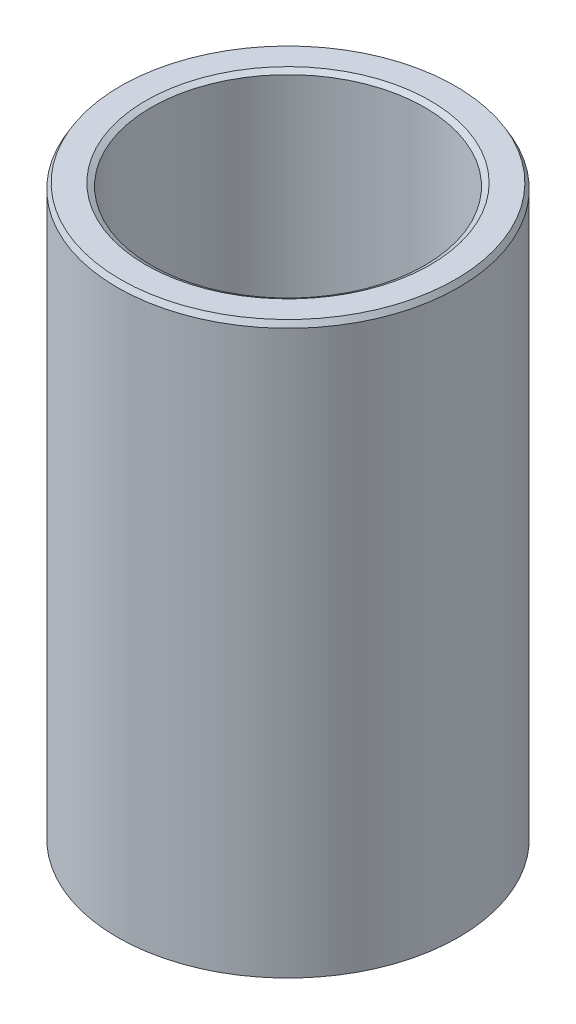
ISO-10303-21;
HEADER;
FILE_DESCRIPTION(('STEP AP214'),'2;1');
FILE_NAME('part.step','',(''),(''),'','','');
FILE_SCHEMA(('AUTOMOTIVE_DESIGN { 1 0 10303 214 1 1 1 1 }'));
ENDSEC;
DATA;
#1=APPLICATION_CONTEXT('core data for automotive mechanical design processes');
#2=APPLICATION_PROTOCOL_DEFINITION('international standard','automotive_design',2000,#1);
#3=PRODUCT_CONTEXT('',#1,'mechanical');
#4=PRODUCT('Part','Part','',(#3));
#5=PRODUCT_RELATED_PRODUCT_CATEGORY('part','',(#4));
#6=PRODUCT_DEFINITION_FORMATION('','',#4);
#7=PRODUCT_DEFINITION_CONTEXT('part definition',#1,'design');
#8=PRODUCT_DEFINITION('design','',#6,#7);
#9=PRODUCT_DEFINITION_SHAPE('','',#8);
#10=(LENGTH_UNIT() NAMED_UNIT(*) SI_UNIT(.MILLI.,.METRE.));
#11=(NAMED_UNIT(*) PLANE_ANGLE_UNIT() SI_UNIT($,.RADIAN.));
#12=(NAMED_UNIT(*) SI_UNIT($,.STERADIAN.) SOLID_ANGLE_UNIT());
#13=UNCERTAINTY_MEASURE_WITH_UNIT(LENGTH_MEASURE(1.E-05),#10,'distance_accuracy_value','');
#14=(GEOMETRIC_REPRESENTATION_CONTEXT(3) GLOBAL_UNCERTAINTY_ASSIGNED_CONTEXT((#13)) GLOBAL_UNIT_ASSIGNED_CONTEXT((#10,
#11,#12)) REPRESENTATION_CONTEXT('',''));
#15=CARTESIAN_POINT('',(0.,0.,0.));
#16=DIRECTION('',(0.,0.,1.));
#17=DIRECTION('',(1.,0.,0.));
#18=AXIS2_PLACEMENT_3D('',#15,#16,#17);
#19=CARTESIAN_POINT('',(0.,159.028613573859,0.));
#20=DIRECTION('',(0.,-1.,0.));
#21=DIRECTION('',(0.,0.,-1.));
#22=AXIS2_PLACEMENT_3D('',#19,#20,#21);
#23=CYLINDRICAL_SURFACE('',#22,47.5);
#24=CARTESIAN_POINT('',(0.,0.870869365566102,0.));
#25=DIRECTION('',(0.,1.,0.));
#26=DIRECTION('',(0.,0.,1.));
#27=AXIS2_PLACEMENT_3D('',#24,#25,#26);
#28=CIRCLE('',#27,47.5);
#29=CARTESIAN_POINT('',(0.,0.870869365566102,47.5));
#30=VERTEX_POINT('',#29);
#31=EDGE_CURVE('E10',#30,#30,#28,.T.);
#32=ORIENTED_EDGE('',*,*,#31,.T.);
#33=EDGE_LOOP('',(#32));
#34=FACE_BOUND('',#33,.T.);
#35=CARTESIAN_POINT('',(0.,157.520223585944,0.));
#36=DIRECTION('',(0.,1.,0.));
#37=DIRECTION('',(0.,0.,1.));
#38=AXIS2_PLACEMENT_3D('',#35,#36,#37);
#39=CIRCLE('',#38,47.5);
#40=CARTESIAN_POINT('',(0.,157.520223585944,47.5));
#41=VERTEX_POINT('',#40);
#42=EDGE_CURVE('E50',#41,#41,#39,.F.);
#43=ORIENTED_EDGE('',*,*,#42,.T.);
#44=EDGE_LOOP('',(#43));
#45=FACE_BOUND('',#44,.T.);
#46=ADVANCED_FACE('F39',(#34,#45),#23,.T.);
#47=CARTESIAN_POINT('',(0.,159.028613573859,0.));
#48=DIRECTION('',(0.,1.,0.));
#49=DIRECTION('',(0.,0.,1.));
#50=AXIS2_PLACEMENT_3D('',#47,#48,#49);
#51=PLANE('',#50);
#52=CARTESIAN_POINT('',(0.,159.028613573859,0.));
#53=DIRECTION('',(0.,1.,0.));
#54=DIRECTION('',(0.,0.,1.));
#55=AXIS2_PLACEMENT_3D('',#52,#53,#54);
#56=CIRCLE('',#55,39.5979061303683);
#57=CARTESIAN_POINT('',(0.,159.028613573859,39.5979061303683));
#58=VERTEX_POINT('',#57);
#59=EDGE_CURVE('E58',#58,#58,#56,.F.);
#60=ORIENTED_EDGE('',*,*,#59,.T.);
#61=EDGE_LOOP('',(#60));
#62=FACE_BOUND('',#61,.T.);
#63=CARTESIAN_POINT('',(0.,159.028613573859,0.));
#64=DIRECTION('',(0.,1.,0.));
#65=DIRECTION('',(0.,0.,1.));
#66=AXIS2_PLACEMENT_3D('',#63,#64,#65);
#67=CIRCLE('',#66,46.6291306344339);
#68=CARTESIAN_POINT('',(0.,159.028613573859,46.6291306344339));
#69=VERTEX_POINT('',#68);
#70=EDGE_CURVE('E61',#69,#69,#67,.T.);
#71=ORIENTED_EDGE('',*,*,#70,.T.);
#72=EDGE_LOOP('',(#71));
#73=FACE_BOUND('',#72,.T.);
#74=ADVANCED_FACE('F88',(#62,#73),#51,.T.);
#75=CARTESIAN_POINT('',(0.,0.,0.));
#76=DIRECTION('',(0.,1.,0.));
#77=DIRECTION('',(0.,0.,1.));
#78=AXIS2_PLACEMENT_3D('',#75,#76,#77);
#79=PLANE('',#78);
#80=CARTESIAN_POINT('',(0.,0.,0.));
#81=DIRECTION('',(0.,1.,0.));
#82=DIRECTION('',(0.,0.,1.));
#83=AXIS2_PLACEMENT_3D('',#80,#81,#82);
#84=CIRCLE('',#83,38.9603855080186);
#85=CARTESIAN_POINT('',(0.,0.,-38.9603855080186));
#86=VERTEX_POINT('',#85);
#87=EDGE_CURVE('E51',#86,#86,#84,.T.);
#88=ORIENTED_EDGE('',*,*,#87,.T.);
#89=EDGE_LOOP('',(#88));
#90=FACE_BOUND('',#89,.T.);
#91=CARTESIAN_POINT('',(0.,0.,0.));
#92=DIRECTION('',(0.,1.,0.));
#93=DIRECTION('',(0.,0.,1.));
#94=AXIS2_PLACEMENT_3D('',#91,#92,#93);
#95=CIRCLE('',#94,45.9916100120842);
#96=CARTESIAN_POINT('',(0.,0.,45.9916100120842));
#97=VERTEX_POINT('',#96);
#98=EDGE_CURVE('E54',#97,#97,#95,.F.);
#99=ORIENTED_EDGE('',*,*,#98,.T.);
#100=EDGE_LOOP('',(#99));
#101=FACE_BOUND('',#100,.T.);
#102=ADVANCED_FACE('F83',(#90,#101),#79,.F.);
#103=CARTESIAN_POINT('',(0.,159.028613573859,0.));
#104=DIRECTION('',(0.,-1.,0.));
#105=DIRECTION('',(0.,0.,-1.));
#106=AXIS2_PLACEMENT_3D('',#103,#104,#105);
#107=CYLINDRICAL_SURFACE('',#106,38.0895161424525);
#108=CARTESIAN_POINT('',(0.,158.157744208293,0.));
#109=DIRECTION('',(0.,1.,0.));
#110=DIRECTION('',(0.,0.,1.));
#111=AXIS2_PLACEMENT_3D('',#108,#109,#110);
#112=CIRCLE('',#111,38.0895161424525);
#113=CARTESIAN_POINT('',(0.,158.157744208293,38.0895161424525));
#114=VERTEX_POINT('',#113);
#115=EDGE_CURVE('E67',#114,#114,#112,.T.);
#116=ORIENTED_EDGE('',*,*,#115,.T.);
#117=EDGE_LOOP('',(#116));
#118=FACE_BOUND('',#117,.T.);
#119=CARTESIAN_POINT('',(0.,1.5083899879158,0.));
#120=DIRECTION('',(0.,1.,0.));
#121=DIRECTION('',(0.,0.,1.));
#122=AXIS2_PLACEMENT_3D('',#119,#120,#121);
#123=CIRCLE('',#122,38.0895161424525);
#124=CARTESIAN_POINT('',(0.,1.5083899879158,-38.0895161424525));
#125=VERTEX_POINT('',#124);
#126=EDGE_CURVE('E69',#125,#125,#123,.F.);
#127=ORIENTED_EDGE('',*,*,#126,.T.);
#128=EDGE_LOOP('',(#127));
#129=FACE_BOUND('',#128,.T.);
#130=ADVANCED_FACE('F71',(#118,#129),#107,.F.);
#131=CARTESIAN_POINT('',(0.,158.157744208293,0.));
#132=DIRECTION('',(0.,1.,0.));
#133=DIRECTION('',(0.,0.,1.));
#134=AXIS2_PLACEMENT_3D('',#131,#132,#133);
#135=CONICAL_SURFACE('',#134,38.0895161424525,1.0471975511966);
#136=ORIENTED_EDGE('',*,*,#59,.F.);
#137=EDGE_LOOP('',(#136));
#138=FACE_BOUND('',#137,.T.);
#139=ORIENTED_EDGE('',*,*,#115,.F.);
#140=EDGE_LOOP('',(#139));
#141=FACE_BOUND('',#140,.T.);
#142=ADVANCED_FACE('F77',(#138,#141),#135,.F.);
#143=CARTESIAN_POINT('',(0.,0.,0.));
#144=DIRECTION('',(0.,-1.,0.));
#145=DIRECTION('',(0.,0.,-1.));
#146=AXIS2_PLACEMENT_3D('',#143,#144,#145);
#147=CONICAL_SURFACE('',#146,38.9603855080186,0.523598775598301);
#148=CARTESIAN_POINT('',(0.,1.5083899879158,-38.0895161424525));
#149=CARTESIAN_POINT('',(0.,1.49267759220835,-38.0985876983438));
#150=CARTESIAN_POINT('',(0.,1.47696519650089,-38.1076592542351));
#151=CARTESIAN_POINT('',(0.,1.44554040508598,-38.1258023660177));
#152=CARTESIAN_POINT('',(0.,1.42982800937852,-38.134873921909));
#153=CARTESIAN_POINT('',(0.,1.39840321796361,-38.1530170336917));
#154=CARTESIAN_POINT('',(0.,1.38269082225615,-38.162088589583));
#155=CARTESIAN_POINT('',(0.,1.35126603084124,-38.1802317013656));
#156=CARTESIAN_POINT('',(0.,1.33555363513378,-38.1893032572569));
#157=CARTESIAN_POINT('',(0.,1.30412884371887,-38.2074463690395));
#158=CARTESIAN_POINT('',(0.,1.28841644801142,-38.2165179249309));
#159=CARTESIAN_POINT('',(0.,1.2569916565965,-38.2346610367135));
#160=CARTESIAN_POINT('',(0.,1.24127926088905,-38.2437325926048));
#161=CARTESIAN_POINT('',(0.,1.20985446947413,-38.2618757043874));
#162=CARTESIAN_POINT('',(0.,1.19414207376668,-38.2709472602788));
#163=CARTESIAN_POINT('',(0.,1.16271728235177,-38.2890903720614));
#164=CARTESIAN_POINT('',(0.,1.14700488664431,-38.2981619279527));
#165=CARTESIAN_POINT('',(0.,1.1155800952294,-38.3163050397353));
#166=CARTESIAN_POINT('',(0.,1.09986769952194,-38.3253765956266));
#167=CARTESIAN_POINT('',(0.,1.06844290810703,-38.3435197074093));
#168=CARTESIAN_POINT('',(0.,1.05273051239957,-38.3525912633006));
#169=CARTESIAN_POINT('',(0.,1.02130572098466,-38.3707343750832));
#170=CARTESIAN_POINT('',(0.,1.0055933252772,-38.3798059309745));
#171=CARTESIAN_POINT('',(0.,0.97416853386229,-38.3979490427571));
#172=CARTESIAN_POINT('',(0.,0.958456138154833,-38.4070205986485));
#173=CARTESIAN_POINT('',(0.,0.927031346739921,-38.4251637104311));
#174=CARTESIAN_POINT('',(0.,0.911318951032465,-38.4342352663224));
#175=CARTESIAN_POINT('',(0.,0.879894159617552,-38.452378378105));
#176=CARTESIAN_POINT('',(0.,0.864181763910096,-38.4614499339963));
#177=CARTESIAN_POINT('',(0.,0.832756972495183,-38.479593045779));
#178=CARTESIAN_POINT('',(0.,0.817044576787727,-38.4886646016703));
#179=CARTESIAN_POINT('',(0.,0.785619785372814,-38.5068077134529));
#180=CARTESIAN_POINT('',(0.,0.769907389665358,-38.5158792693442));
#181=CARTESIAN_POINT('',(0.,0.738482598250445,-38.5340223811268));
#182=CARTESIAN_POINT('',(0.,0.722770202542989,-38.5430939370182));
#183=CARTESIAN_POINT('',(0.,0.691345411128077,-38.5612370488008));
#184=CARTESIAN_POINT('',(0.,0.67563301542062,-38.5703086046921));
#185=CARTESIAN_POINT('',(0.,0.644208224005708,-38.5884517164747));
#186=CARTESIAN_POINT('',(0.,0.628495828298251,-38.597523272366));
#187=CARTESIAN_POINT('',(0.,0.597071036883339,-38.6156663841487));
#188=CARTESIAN_POINT('',(0.,0.581358641175883,-38.62473794004));
#189=CARTESIAN_POINT('',(0.,0.54993384976097,-38.6428810518226));
#190=CARTESIAN_POINT('',(0.,0.534221454053514,-38.6519526077139));
#191=CARTESIAN_POINT('',(0.,0.502796662638601,-38.6700957194966));
#192=CARTESIAN_POINT('',(0.,0.487084266931145,-38.6791672753879));
#193=CARTESIAN_POINT('',(0.,0.455659475516232,-38.6973103871705));
#194=CARTESIAN_POINT('',(0.,0.439947079808776,-38.7063819430618));
#195=CARTESIAN_POINT('',(0.,0.408522288393863,-38.7245250548444));
#196=CARTESIAN_POINT('',(0.,0.392809892686407,-38.7335966107358));
#197=CARTESIAN_POINT('',(0.,0.361385101271495,-38.7517397225184));
#198=CARTESIAN_POINT('',(0.,0.345672705564038,-38.7608112784097));
#199=CARTESIAN_POINT('',(0.,0.314247914149126,-38.7789543901923));
#200=CARTESIAN_POINT('',(0.,0.298535518441669,-38.7880259460836));
#201=CARTESIAN_POINT('',(0.,0.267110727026757,-38.8061690578663));
#202=CARTESIAN_POINT('',(0.,0.251398331319301,-38.8152406137576));
#203=CARTESIAN_POINT('',(0.,0.219973539904388,-38.8333837255402));
#204=CARTESIAN_POINT('',(0.,0.204261144196932,-38.8424552814315));
#205=CARTESIAN_POINT('',(0.,0.172836352782019,-38.8605983932141));
#206=CARTESIAN_POINT('',(0.,0.157123957074563,-38.8696699491055));
#207=CARTESIAN_POINT('',(0.,0.12569916565965,-38.8878130608881));
#208=CARTESIAN_POINT('',(0.,0.109986769952194,-38.8968846167794));
#209=CARTESIAN_POINT('',(0.,0.0785619785372814,-38.915027728562));
#210=CARTESIAN_POINT('',(0.,0.0628495828298251,-38.9240992844533));
#211=CARTESIAN_POINT('',(0.,0.0314247914149126,-38.942242396236));
#212=CARTESIAN_POINT('',(0.,0.0157123957074563,-38.9513139521273));
#213=CARTESIAN_POINT('',(0.,0.,-38.9603855080186));
#214=B_SPLINE_CURVE_WITH_KNOTS('',3,(#148,#149,#150,#151,#152,#153,#154,#155,#156,#157,#158,
#159,#160,#161,#162,#163,#164,#165,#166,#167,#168,#169,#170,#171,#172,#173,#174,#175,#176,#177,
#178,#179,#180,#181,#182,#183,#184,#185,#186,#187,#188,#189,#190,#191,#192,#193,#194,#195,#196,
#197,#198,#199,#200,#201,#202,#203,#204,#205,#206,#207,#208,#209,#210,#211,#212,#213),
.UNSPECIFIED.,.F.,.F.,(4,2,2,2,2,2,2,2,2,2,2,2,2,2,2,2,2,2,2,2,2,2,2,2,2,2,2,2,2,2,2,2,4),(0.,
0.0544293353478829,0.108858670695766,0.163288006043649,0.217717341391532,0.272146676739415,
0.326576012087297,0.38100534743518,0.435434682783063,0.489864018130946,0.544293353478829,
0.598722688826712,0.653152024174595,0.707581359522478,0.762010694870361,0.816440030218243,
0.870869365566126,0.925298700914009,0.979728036261892,1.03415737160977,1.08858670695766,
1.14301604230554,1.19744537765342,1.25187471300131,1.30630404834919,1.36073338369707,
1.41516271904495,1.46959205439284,1.52402138974072,1.5784507250886,1.63288006043649,
1.68730939578437,1.74173873113225),.UNSPECIFIED.);
#215=EDGE_CURVE('BSEAM73',#125,#86,#214,.T.);
#216=ORIENTED_EDGE('',*,*,#126,.F.);
#217=ORIENTED_EDGE('',*,*,#87,.F.);
#218=ORIENTED_EDGE('',*,*,#215,.T.);
#219=ORIENTED_EDGE('',*,*,#215,.F.);
#220=EDGE_LOOP('',(#216,#218,#217,#219));
#221=FACE_BOUND('',#220,.T.);
#222=ADVANCED_FACE('F73',(#221),#147,.F.);
#223=CARTESIAN_POINT('',(0.,0.870869365566102,0.));
#224=DIRECTION('',(0.,1.,0.));
#225=DIRECTION('',(0.,0.,1.));
#226=AXIS2_PLACEMENT_3D('',#223,#224,#225);
#227=CONICAL_SURFACE('',#226,47.5,1.0471975511966);
#228=ORIENTED_EDGE('',*,*,#98,.F.);
#229=EDGE_LOOP('',(#228));
#230=FACE_BOUND('',#229,.T.);
#231=ORIENTED_EDGE('',*,*,#31,.F.);
#232=EDGE_LOOP('',(#231));
#233=FACE_BOUND('',#232,.T.);
#234=ADVANCED_FACE('F76',(#230,#233),#227,.T.);
#235=CARTESIAN_POINT('',(0.,159.028613573859,0.));
#236=DIRECTION('',(0.,-1.,0.));
#237=DIRECTION('',(0.,0.,-1.));
#238=AXIS2_PLACEMENT_3D('',#235,#236,#237);
#239=CONICAL_SURFACE('',#238,46.6291306344339,0.523598775598292);
#240=ORIENTED_EDGE('',*,*,#42,.F.);
#241=EDGE_LOOP('',(#240));
#242=FACE_BOUND('',#241,.T.);
#243=ORIENTED_EDGE('',*,*,#70,.F.);
#244=EDGE_LOOP('',(#243));
#245=FACE_BOUND('',#244,.T.);
#246=ADVANCED_FACE('F45',(#242,#245),#239,.T.);
#247=CLOSED_SHELL('',(#46,#74,#102,#130,#142,#222,#234,#246));
#248=MANIFOLD_SOLID_BREP('B2',#247);
#249=ADVANCED_BREP_SHAPE_REPRESENTATION('',(#18,#248),#14);
#250=SHAPE_DEFINITION_REPRESENTATION(#9,#249);
ENDSEC;
END-ISO-10303-21;
